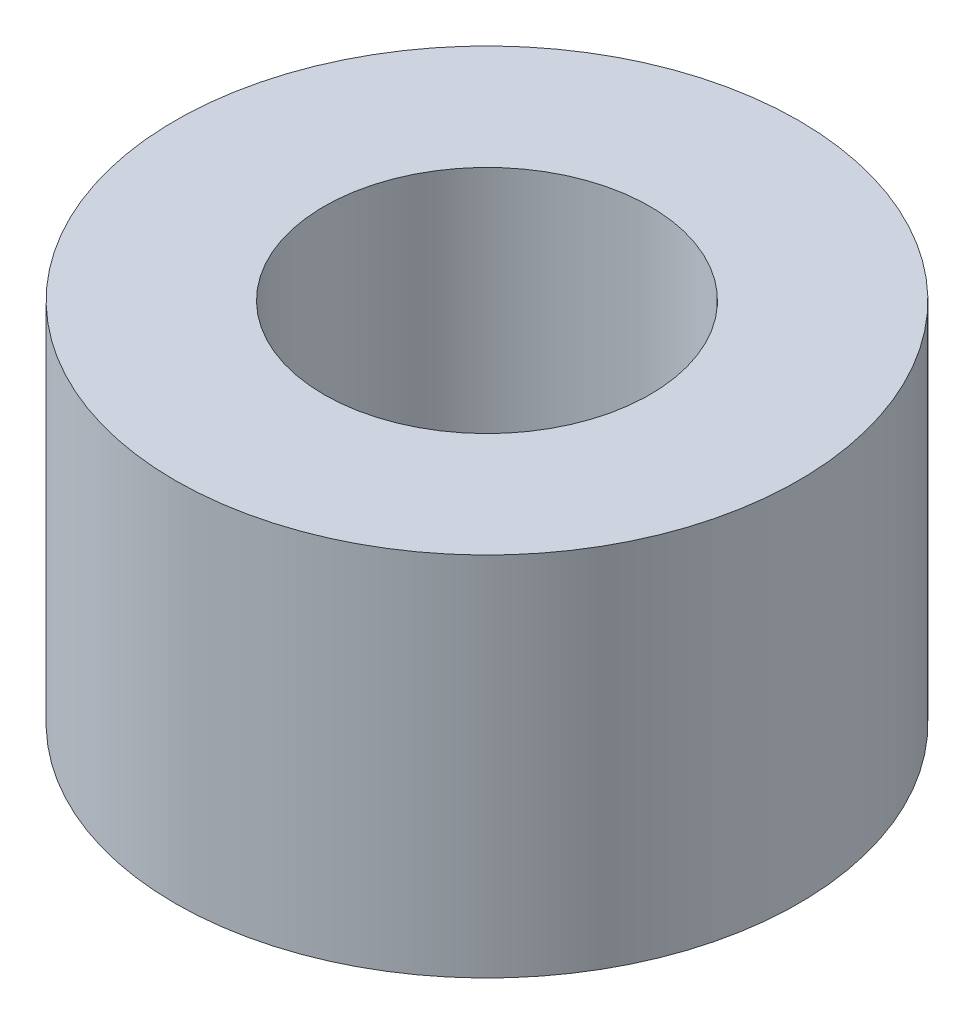
ISO-10303-21;
HEADER;
FILE_DESCRIPTION(('STEP AP214'),'2;1');
FILE_NAME('part.step','',(''),(''),'','','');
FILE_SCHEMA(('AUTOMOTIVE_DESIGN { 1 0 10303 214 1 1 1 1 }'));
ENDSEC;
DATA;
#1=APPLICATION_CONTEXT('core data for automotive mechanical design processes');
#2=APPLICATION_PROTOCOL_DEFINITION('international standard','automotive_design',2000,#1);
#3=PRODUCT_CONTEXT('',#1,'mechanical');
#4=PRODUCT('Part','Part','',(#3));
#5=PRODUCT_RELATED_PRODUCT_CATEGORY('part','',(#4));
#6=PRODUCT_DEFINITION_FORMATION('','',#4);
#7=PRODUCT_DEFINITION_CONTEXT('part definition',#1,'design');
#8=PRODUCT_DEFINITION('design','',#6,#7);
#9=PRODUCT_DEFINITION_SHAPE('','',#8);
#10=(LENGTH_UNIT() NAMED_UNIT(*) SI_UNIT(.MILLI.,.METRE.));
#11=(NAMED_UNIT(*) PLANE_ANGLE_UNIT() SI_UNIT($,.RADIAN.));
#12=(NAMED_UNIT(*) SI_UNIT($,.STERADIAN.) SOLID_ANGLE_UNIT());
#13=UNCERTAINTY_MEASURE_WITH_UNIT(LENGTH_MEASURE(1.E-05),#10,'distance_accuracy_value','');
#14=(GEOMETRIC_REPRESENTATION_CONTEXT(3) GLOBAL_UNCERTAINTY_ASSIGNED_CONTEXT((#13)) GLOBAL_UNIT_ASSIGNED_CONTEXT((#10,
#11,#12)) REPRESENTATION_CONTEXT('',''));
#15=CARTESIAN_POINT('',(0.,0.,0.));
#16=DIRECTION('',(0.,0.,1.));
#17=DIRECTION('',(1.,0.,0.));
#18=AXIS2_PLACEMENT_3D('',#15,#16,#17);
#19=CARTESIAN_POINT('',(0.,5.,0.));
#20=DIRECTION('',(0.,1.,0.));
#21=DIRECTION('',(0.,0.,1.));
#22=AXIS2_PLACEMENT_3D('',#19,#20,#21);
#23=PLANE('',#22);
#24=CARTESIAN_POINT('',(0.,5.,0.));
#25=DIRECTION('',(0.,1.,0.));
#26=DIRECTION('',(0.,0.,1.));
#27=AXIS2_PLACEMENT_3D('',#24,#25,#26);
#28=CIRCLE('',#27,4.255);
#29=CARTESIAN_POINT('',(0.,5.,4.255));
#30=VERTEX_POINT('',#29);
#31=EDGE_CURVE('E10',#30,#30,#28,.T.);
#32=ORIENTED_EDGE('',*,*,#31,.T.);
#33=EDGE_LOOP('',(#32));
#34=FACE_BOUND('',#33,.T.);
#35=CARTESIAN_POINT('',(0.,5.,0.));
#36=DIRECTION('',(0.,1.,0.));
#37=DIRECTION('',(0.,0.,1.));
#38=AXIS2_PLACEMENT_3D('',#35,#36,#37);
#39=CIRCLE('',#38,2.225);
#40=CARTESIAN_POINT('',(0.,5.,2.225));
#41=VERTEX_POINT('',#40);
#42=EDGE_CURVE('E54',#41,#41,#39,.T.);
#43=ORIENTED_EDGE('',*,*,#42,.F.);
#44=EDGE_LOOP('',(#43));
#45=FACE_BOUND('',#44,.T.);
#46=ADVANCED_FACE('F41',(#34,#45),#23,.T.);
#47=CARTESIAN_POINT('',(0.,0.,0.));
#48=DIRECTION('',(0.,1.,0.));
#49=DIRECTION('',(0.,0.,1.));
#50=AXIS2_PLACEMENT_3D('',#47,#48,#49);
#51=PLANE('',#50);
#52=CARTESIAN_POINT('',(0.,0.,0.));
#53=DIRECTION('',(0.,1.,0.));
#54=DIRECTION('',(0.,0.,1.));
#55=AXIS2_PLACEMENT_3D('',#52,#53,#54);
#56=CIRCLE('',#55,4.255);
#57=CARTESIAN_POINT('',(0.,0.,4.255));
#58=VERTEX_POINT('',#57);
#59=EDGE_CURVE('E45',#58,#58,#56,.T.);
#60=ORIENTED_EDGE('',*,*,#59,.F.);
#61=EDGE_LOOP('',(#60));
#62=FACE_BOUND('',#61,.T.);
#63=CARTESIAN_POINT('',(0.,0.,0.));
#64=DIRECTION('',(0.,1.,0.));
#65=DIRECTION('',(0.,0.,1.));
#66=AXIS2_PLACEMENT_3D('',#63,#64,#65);
#67=CIRCLE('',#66,2.225);
#68=CARTESIAN_POINT('',(0.,0.,2.225));
#69=VERTEX_POINT('',#68);
#70=EDGE_CURVE('E56',#69,#69,#67,.T.);
#71=ORIENTED_EDGE('',*,*,#70,.T.);
#72=EDGE_LOOP('',(#71));
#73=FACE_BOUND('',#72,.T.);
#74=ADVANCED_FACE('F68',(#62,#73),#51,.F.);
#75=CARTESIAN_POINT('',(0.,5.,0.));
#76=DIRECTION('',(0.,-1.,0.));
#77=DIRECTION('',(0.,0.,-1.));
#78=AXIS2_PLACEMENT_3D('',#75,#76,#77);
#79=CYLINDRICAL_SURFACE('',#78,4.255);
#80=ORIENTED_EDGE('',*,*,#31,.F.);
#81=EDGE_LOOP('',(#80));
#82=FACE_BOUND('',#81,.T.);
#83=ORIENTED_EDGE('',*,*,#59,.T.);
#84=EDGE_LOOP('',(#83));
#85=FACE_BOUND('',#84,.T.);
#86=ADVANCED_FACE('F43',(#82,#85),#79,.T.);
#87=CARTESIAN_POINT('',(0.,5.,0.));
#88=DIRECTION('',(0.,-1.,0.));
#89=DIRECTION('',(0.,0.,-1.));
#90=AXIS2_PLACEMENT_3D('',#87,#88,#89);
#91=CYLINDRICAL_SURFACE('',#90,2.225);
#92=ORIENTED_EDGE('',*,*,#42,.T.);
#93=EDGE_LOOP('',(#92));
#94=FACE_BOUND('',#93,.T.);
#95=ORIENTED_EDGE('',*,*,#70,.F.);
#96=EDGE_LOOP('',(#95));
#97=FACE_BOUND('',#96,.T.);
#98=ADVANCED_FACE('F64',(#94,#97),#91,.F.);
#99=CLOSED_SHELL('',(#46,#74,#86,#98));
#100=MANIFOLD_SOLID_BREP('B2',#99);
#101=ADVANCED_BREP_SHAPE_REPRESENTATION('',(#18,#100),#14);
#102=SHAPE_DEFINITION_REPRESENTATION(#9,#101);
ENDSEC;
END-ISO-10303-21;
